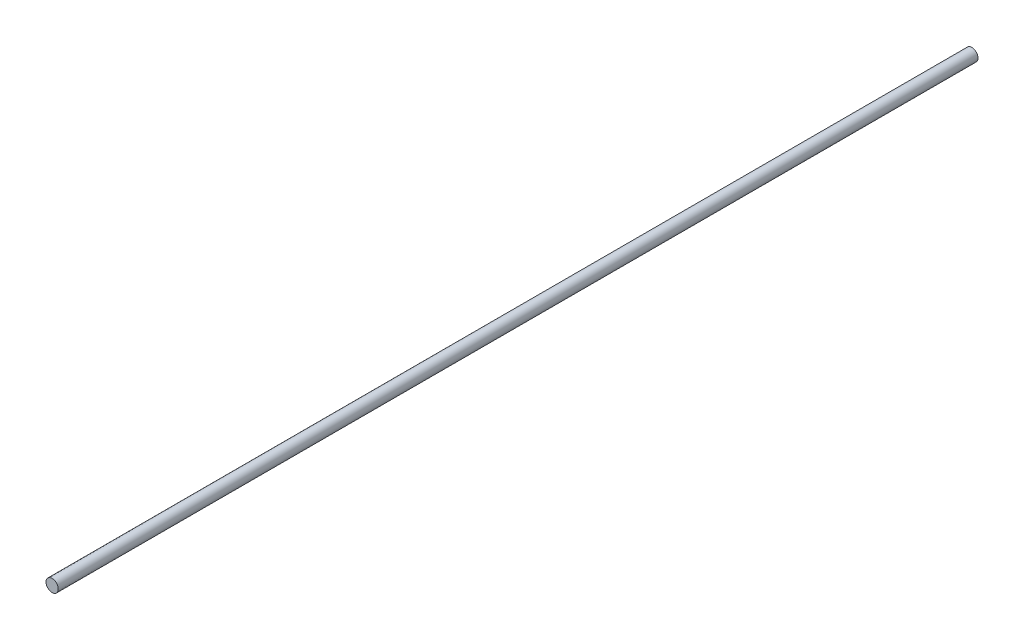
ISO-10303-21;
HEADER;
FILE_DESCRIPTION(('STEP AP214'),'2;1');
FILE_NAME('part.step','',(''),(''),'','','');
FILE_SCHEMA(('AUTOMOTIVE_DESIGN { 1 0 10303 214 1 1 1 1 }'));
ENDSEC;
DATA;
#1=APPLICATION_CONTEXT('core data for automotive mechanical design processes');
#2=APPLICATION_PROTOCOL_DEFINITION('international standard','automotive_design',2000,#1);
#3=PRODUCT_CONTEXT('',#1,'mechanical');
#4=PRODUCT('Part','Part','',(#3));
#5=PRODUCT_RELATED_PRODUCT_CATEGORY('part','',(#4));
#6=PRODUCT_DEFINITION_FORMATION('','',#4);
#7=PRODUCT_DEFINITION_CONTEXT('part definition',#1,'design');
#8=PRODUCT_DEFINITION('design','',#6,#7);
#9=PRODUCT_DEFINITION_SHAPE('','',#8);
#10=(LENGTH_UNIT() NAMED_UNIT(*) SI_UNIT(.MILLI.,.METRE.));
#11=(NAMED_UNIT(*) PLANE_ANGLE_UNIT() SI_UNIT($,.RADIAN.));
#12=(NAMED_UNIT(*) SI_UNIT($,.STERADIAN.) SOLID_ANGLE_UNIT());
#13=UNCERTAINTY_MEASURE_WITH_UNIT(LENGTH_MEASURE(1.E-05),#10,'distance_accuracy_value','');
#14=(GEOMETRIC_REPRESENTATION_CONTEXT(3) GLOBAL_UNCERTAINTY_ASSIGNED_CONTEXT((#13)) GLOBAL_UNIT_ASSIGNED_CONTEXT((#10,
#11,#12)) REPRESENTATION_CONTEXT('',''));
#15=CARTESIAN_POINT('',(0.,0.,0.));
#16=DIRECTION('',(0.,0.,1.));
#17=DIRECTION('',(1.,0.,0.));
#18=AXIS2_PLACEMENT_3D('',#15,#16,#17);
#19=CARTESIAN_POINT('',(0.,0.,600.));
#20=DIRECTION('',(0.,0.,-1.));
#21=DIRECTION('',(-1.,0.,0.));
#22=AXIS2_PLACEMENT_3D('',#19,#20,#21);
#23=CYLINDRICAL_SURFACE('',#22,4.);
#24=CARTESIAN_POINT('',(0.,0.,600.));
#25=DIRECTION('',(0.,0.,1.));
#26=DIRECTION('',(1.,0.,0.));
#27=AXIS2_PLACEMENT_3D('',#24,#25,#26);
#28=CIRCLE('',#27,4.);
#29=CARTESIAN_POINT('',(4.,0.,600.));
#30=VERTEX_POINT('',#29);
#31=EDGE_CURVE('E10',#30,#30,#28,.T.);
#32=ORIENTED_EDGE('',*,*,#31,.F.);
#33=EDGE_LOOP('',(#32));
#34=FACE_BOUND('',#33,.T.);
#35=CARTESIAN_POINT('',(0.,0.,0.));
#36=DIRECTION('',(0.,0.,1.));
#37=DIRECTION('',(1.,0.,0.));
#38=AXIS2_PLACEMENT_3D('',#35,#36,#37);
#39=CIRCLE('',#38,4.);
#40=CARTESIAN_POINT('',(4.,0.,0.));
#41=VERTEX_POINT('',#40);
#42=EDGE_CURVE('E37',#41,#41,#39,.T.);
#43=ORIENTED_EDGE('',*,*,#42,.T.);
#44=EDGE_LOOP('',(#43));
#45=FACE_BOUND('',#44,.T.);
#46=ADVANCED_FACE('F34',(#34,#45),#23,.T.);
#47=CARTESIAN_POINT('',(0.,0.,600.));
#48=DIRECTION('',(0.,0.,1.));
#49=DIRECTION('',(1.,0.,0.));
#50=AXIS2_PLACEMENT_3D('',#47,#48,#49);
#51=PLANE('',#50);
#52=ORIENTED_EDGE('',*,*,#31,.T.);
#53=EDGE_LOOP('',(#52));
#54=FACE_BOUND('',#53,.T.);
#55=ADVANCED_FACE('F49',(#54),#51,.T.);
#56=CARTESIAN_POINT('',(0.,0.,0.));
#57=DIRECTION('',(0.,0.,1.));
#58=DIRECTION('',(1.,0.,0.));
#59=AXIS2_PLACEMENT_3D('',#56,#57,#58);
#60=PLANE('',#59);
#61=ORIENTED_EDGE('',*,*,#42,.F.);
#62=EDGE_LOOP('',(#61));
#63=FACE_BOUND('',#62,.T.);
#64=ADVANCED_FACE('F47',(#63),#60,.F.);
#65=CLOSED_SHELL('',(#46,#55,#64));
#66=MANIFOLD_SOLID_BREP('B2',#65);
#67=ADVANCED_BREP_SHAPE_REPRESENTATION('',(#18,#66),#14);
#68=SHAPE_DEFINITION_REPRESENTATION(#9,#67);
ENDSEC;
END-ISO-10303-21;
